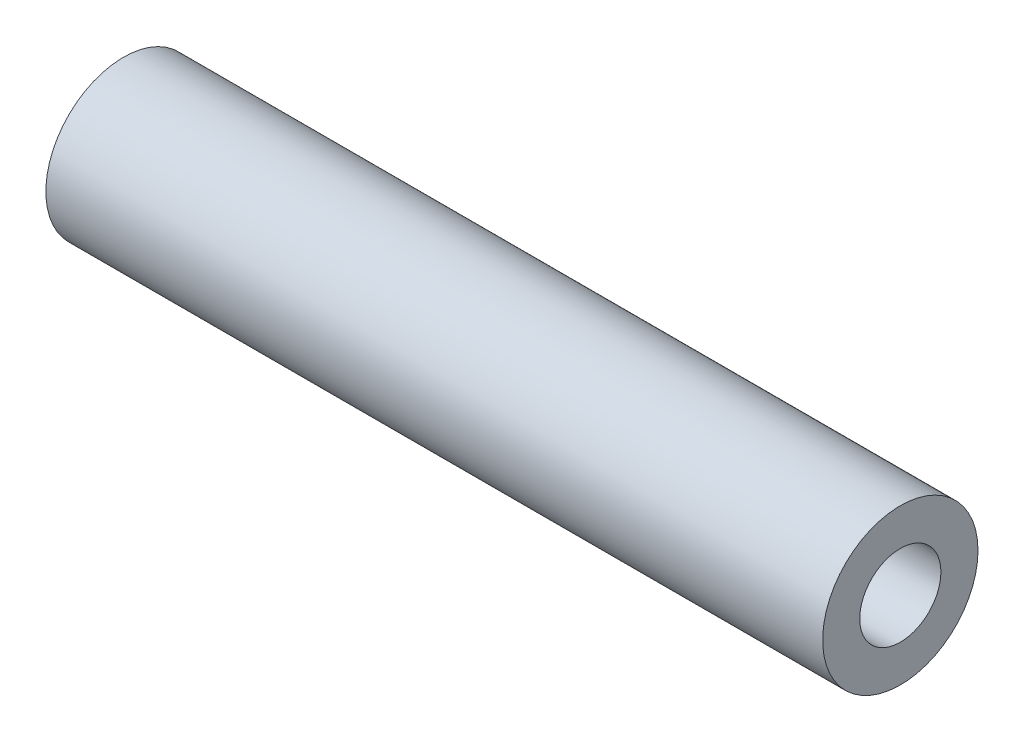
ISO-10303-21;
HEADER;
FILE_DESCRIPTION(('STEP AP214'),'2;1');
FILE_NAME('part.step','',(''),(''),'','','');
FILE_SCHEMA(('AUTOMOTIVE_DESIGN { 1 0 10303 214 1 1 1 1 }'));
ENDSEC;
DATA;
#1=APPLICATION_CONTEXT('core data for automotive mechanical design processes');
#2=APPLICATION_PROTOCOL_DEFINITION('international standard','automotive_design',2000,#1);
#3=PRODUCT_CONTEXT('',#1,'mechanical');
#4=PRODUCT('Part','Part','',(#3));
#5=PRODUCT_RELATED_PRODUCT_CATEGORY('part','',(#4));
#6=PRODUCT_DEFINITION_FORMATION('','',#4);
#7=PRODUCT_DEFINITION_CONTEXT('part definition',#1,'design');
#8=PRODUCT_DEFINITION('design','',#6,#7);
#9=PRODUCT_DEFINITION_SHAPE('','',#8);
#10=(LENGTH_UNIT() NAMED_UNIT(*) SI_UNIT(.MILLI.,.METRE.));
#11=(NAMED_UNIT(*) PLANE_ANGLE_UNIT() SI_UNIT($,.RADIAN.));
#12=(NAMED_UNIT(*) SI_UNIT($,.STERADIAN.) SOLID_ANGLE_UNIT());
#13=UNCERTAINTY_MEASURE_WITH_UNIT(LENGTH_MEASURE(1.E-05),#10,'distance_accuracy_value','');
#14=(GEOMETRIC_REPRESENTATION_CONTEXT(3) GLOBAL_UNCERTAINTY_ASSIGNED_CONTEXT((#13)) GLOBAL_UNIT_ASSIGNED_CONTEXT((#10,
#11,#12)) REPRESENTATION_CONTEXT('',''));
#15=CARTESIAN_POINT('',(0.,0.,0.));
#16=DIRECTION('',(0.,0.,1.));
#17=DIRECTION('',(1.,0.,0.));
#18=AXIS2_PLACEMENT_3D('',#15,#16,#17);
#19=CARTESIAN_POINT('',(-102.370384181604,0.,0.));
#20=DIRECTION('',(1.,0.,0.));
#21=DIRECTION('',(0.,0.,1.));
#22=AXIS2_PLACEMENT_3D('',#19,#20,#21);
#23=CYLINDRICAL_SURFACE('',#22,4.76250000000001);
#24=CARTESIAN_POINT('',(-41.275,0.,0.));
#25=DIRECTION('',(1.,0.,0.));
#26=DIRECTION('',(0.,0.,-1.));
#27=AXIS2_PLACEMENT_3D('',#24,#25,#26);
#28=CIRCLE('',#27,4.76250000000001);
#29=CARTESIAN_POINT('',(-41.275,0.,-4.76250000000001));
#30=VERTEX_POINT('',#29);
#31=EDGE_CURVE('E50',#30,#30,#28,.T.);
#32=ORIENTED_EDGE('',*,*,#31,.F.);
#33=EDGE_LOOP('',(#32));
#34=FACE_BOUND('',#33,.T.);
#35=CARTESIAN_POINT('',(-88.9,0.,0.));
#36=DIRECTION('',(1.,0.,0.));
#37=DIRECTION('',(0.,0.,-1.));
#38=AXIS2_PLACEMENT_3D('',#35,#36,#37);
#39=CIRCLE('',#38,4.76250000000001);
#40=CARTESIAN_POINT('',(-88.9,0.,-4.76250000000001));
#41=VERTEX_POINT('',#40);
#42=EDGE_CURVE('E41',#41,#41,#39,.T.);
#43=ORIENTED_EDGE('',*,*,#42,.T.);
#44=EDGE_LOOP('',(#43));
#45=FACE_BOUND('',#44,.T.);
#46=ADVANCED_FACE('F37',(#34,#45),#23,.T.);
#47=CARTESIAN_POINT('',(-41.275,0.,0.));
#48=DIRECTION('',(-1.,0.,0.));
#49=DIRECTION('',(0.,0.,-1.));
#50=AXIS2_PLACEMENT_3D('',#47,#48,#49);
#51=PLANE('',#50);
#52=ORIENTED_EDGE('',*,*,#31,.T.);
#53=EDGE_LOOP('',(#52));
#54=FACE_BOUND('',#53,.T.);
#55=CARTESIAN_POINT('',(-41.275,0.,0.));
#56=DIRECTION('',(1.,0.,0.));
#57=DIRECTION('',(0.,0.,-1.));
#58=AXIS2_PLACEMENT_3D('',#55,#56,#57);
#59=CIRCLE('',#58,2.4892);
#60=CARTESIAN_POINT('',(-41.275,0.,-2.4892));
#61=VERTEX_POINT('',#60);
#62=EDGE_CURVE('E45',#61,#61,#59,.T.);
#63=ORIENTED_EDGE('',*,*,#62,.F.);
#64=EDGE_LOOP('',(#63));
#65=FACE_BOUND('',#64,.T.);
#66=ADVANCED_FACE('F64',(#54,#65),#51,.F.);
#67=CARTESIAN_POINT('',(-102.370384181604,0.,0.));
#68=DIRECTION('',(1.,0.,0.));
#69=DIRECTION('',(0.,0.,1.));
#70=AXIS2_PLACEMENT_3D('',#67,#68,#69);
#71=CYLINDRICAL_SURFACE('',#70,2.4892);
#72=ORIENTED_EDGE('',*,*,#62,.T.);
#73=EDGE_LOOP('',(#72));
#74=FACE_BOUND('',#73,.T.);
#75=CARTESIAN_POINT('',(-88.9,0.,0.));
#76=DIRECTION('',(1.,0.,0.));
#77=DIRECTION('',(0.,0.,-1.));
#78=AXIS2_PLACEMENT_3D('',#75,#76,#77);
#79=CIRCLE('',#78,2.4892);
#80=CARTESIAN_POINT('',(-88.9,0.,-2.4892));
#81=VERTEX_POINT('',#80);
#82=EDGE_CURVE('E10',#81,#81,#79,.T.);
#83=ORIENTED_EDGE('',*,*,#82,.F.);
#84=EDGE_LOOP('',(#83));
#85=FACE_BOUND('',#84,.T.);
#86=ADVANCED_FACE('F60',(#74,#85),#71,.F.);
#87=CARTESIAN_POINT('',(-88.9,-25.4,160.02));
#88=DIRECTION('',(-1.,0.,0.));
#89=DIRECTION('',(0.,0.,1.));
#90=AXIS2_PLACEMENT_3D('',#87,#88,#89);
#91=PLANE('',#90);
#92=ORIENTED_EDGE('',*,*,#82,.T.);
#93=EDGE_LOOP('',(#92));
#94=FACE_BOUND('',#93,.T.);
#95=ORIENTED_EDGE('',*,*,#42,.F.);
#96=EDGE_LOOP('',(#95));
#97=FACE_BOUND('',#96,.T.);
#98=ADVANCED_FACE('F39',(#94,#97),#91,.T.);
#99=CLOSED_SHELL('',(#46,#66,#86,#98));
#100=MANIFOLD_SOLID_BREP('B2',#99);
#101=ADVANCED_BREP_SHAPE_REPRESENTATION('',(#18,#100),#14);
#102=SHAPE_DEFINITION_REPRESENTATION(#9,#101);
ENDSEC;
END-ISO-10303-21;
